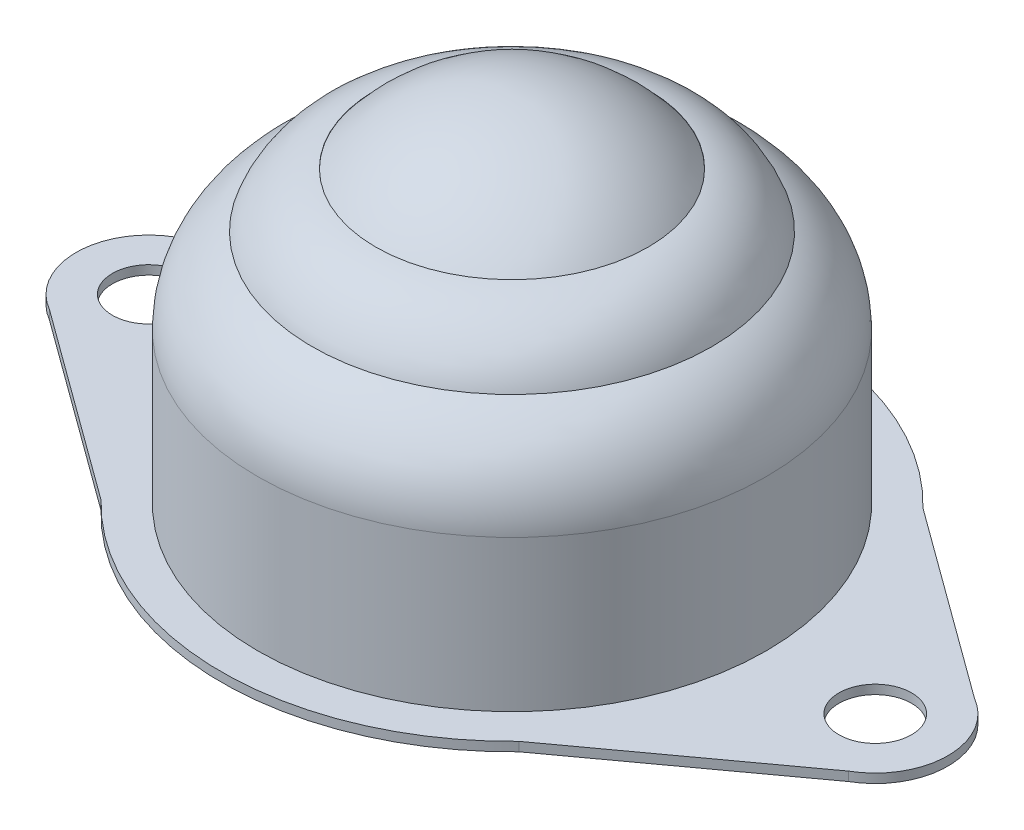
ISO-10303-21;
HEADER;
FILE_DESCRIPTION(('STEP AP214'),'2;1');
FILE_NAME('part.step','',(''),(''),'','','');
FILE_SCHEMA(('AUTOMOTIVE_DESIGN { 1 0 10303 214 1 1 1 1 }'));
ENDSEC;
DATA;
#1=APPLICATION_CONTEXT('core data for automotive mechanical design processes');
#2=APPLICATION_PROTOCOL_DEFINITION('international standard','automotive_design',2000,#1);
#3=PRODUCT_CONTEXT('',#1,'mechanical');
#4=PRODUCT('Part','Part','',(#3));
#5=PRODUCT_RELATED_PRODUCT_CATEGORY('part','',(#4));
#6=PRODUCT_DEFINITION_FORMATION('','',#4);
#7=PRODUCT_DEFINITION_CONTEXT('part definition',#1,'design');
#8=PRODUCT_DEFINITION('design','',#6,#7);
#9=PRODUCT_DEFINITION_SHAPE('','',#8);
#10=(LENGTH_UNIT() NAMED_UNIT(*) SI_UNIT(.MILLI.,.METRE.));
#11=(NAMED_UNIT(*) PLANE_ANGLE_UNIT() SI_UNIT($,.RADIAN.));
#12=(NAMED_UNIT(*) SI_UNIT($,.STERADIAN.) SOLID_ANGLE_UNIT());
#13=UNCERTAINTY_MEASURE_WITH_UNIT(LENGTH_MEASURE(1.E-05),#10,'distance_accuracy_value','');
#14=(GEOMETRIC_REPRESENTATION_CONTEXT(3) GLOBAL_UNCERTAINTY_ASSIGNED_CONTEXT((#13)) GLOBAL_UNIT_ASSIGNED_CONTEXT((#10,
#11,#12)) REPRESENTATION_CONTEXT('',''));
#15=CARTESIAN_POINT('',(0.,0.,0.));
#16=DIRECTION('',(0.,0.,1.));
#17=DIRECTION('',(1.,0.,0.));
#18=AXIS2_PLACEMENT_3D('',#15,#16,#17);
#19=CARTESIAN_POINT('',(0.,9.75,0.));
#20=DIRECTION('',(0.,1.,0.));
#21=DIRECTION('',(1.,0.,0.));
#22=AXIS2_PLACEMENT_3D('',#19,#20,#21);
#23=SPHERICAL_SURFACE('',#22,9.75);
#24=CARTESIAN_POINT('',(0.,19.5,0.));
#25=VERTEX_POINT('',#24);
#26=VERTEX_LOOP('',#25);
#27=FACE_BOUND('',#26,.T.);
#28=ADVANCED_FACE('F44',(#27),#23,.T.);
#29=CLOSED_SHELL('',(#28));
#30=MANIFOLD_SOLID_BREP('B2',#29);
#31=CARTESIAN_POINT('',(0.,8.30667544842264,0.));
#32=DIRECTION('',(0.,-1.,0.));
#33=DIRECTION('',(1.,0.,0.));
#34=AXIS2_PLACEMENT_3D('',#31,#32,#33);
#35=TOROIDAL_SURFACE('',#34,8.82878410892679,5.17121589107318);
#36=CARTESIAN_POINT('',(0.,8.30667544842267,0.));
#37=DIRECTION('',(0.,-1.,0.));
#38=DIRECTION('',(1.,0.,0.));
#39=AXIS2_PLACEMENT_3D('',#36,#37,#38);
#40=CIRCLE('',#39,14.);
#41=CARTESIAN_POINT('',(13.9999999999999,8.30667544842272,0.));
#42=VERTEX_POINT('',#41);
#43=EDGE_CURVE('E184',#42,#42,#40,.T.);
#44=ORIENTED_EDGE('',*,*,#43,.F.);
#45=EDGE_LOOP('',(#44));
#46=FACE_BOUND('',#45,.T.);
#47=CARTESIAN_POINT('',(0.,13.,0.));
#48=DIRECTION('',(0.,-1.,0.));
#49=DIRECTION('',(1.,0.,0.));
#50=AXIS2_PLACEMENT_3D('',#47,#48,#49);
#51=CIRCLE('',#50,10.9999999999999);
#52=CARTESIAN_POINT('',(10.9999999999999,13.0000000000001,0.));
#53=VERTEX_POINT('',#52);
#54=EDGE_CURVE('E42',#53,#53,#51,.T.);
#55=ORIENTED_EDGE('',*,*,#54,.T.);
#56=EDGE_LOOP('',(#55));
#57=FACE_BOUND('',#56,.T.);
#58=ADVANCED_FACE('F56',(#46,#57),#35,.T.);
#59=CARTESIAN_POINT('',(0.,11.5038055215238,0.));
#60=DIRECTION('',(0.,-1.,0.));
#61=DIRECTION('',(1.,0.,0.));
#62=AXIS2_PLACEMENT_3D('',#59,#60,#61);
#63=TOROIDAL_SURFACE('',#62,6.68183330416316,4.57002861374594);
#64=ORIENTED_EDGE('',*,*,#54,.F.);
#65=EDGE_LOOP('',(#64));
#66=FACE_BOUND('',#65,.T.);
#67=CARTESIAN_POINT('',(0.,16.,0.));
#68=DIRECTION('',(0.,-1.,0.));
#69=DIRECTION('',(1.,0.,0.));
#70=AXIS2_PLACEMENT_3D('',#67,#68,#69);
#71=CIRCLE('',#70,7.4999999999999);
#72=CARTESIAN_POINT('',(7.49999999999984,16.,0.));
#73=VERTEX_POINT('',#72);
#74=EDGE_CURVE('E64',#73,#73,#71,.T.);
#75=ORIENTED_EDGE('',*,*,#74,.T.);
#76=EDGE_LOOP('',(#75));
#77=FACE_BOUND('',#76,.T.);
#78=ADVANCED_FACE('F204',(#66,#77),#63,.T.);
#79=CARTESIAN_POINT('',(0.,15.8032312329533,0.));
#80=DIRECTION('',(0.,1.,0.));
#81=DIRECTION('',(-1.,0.,0.));
#82=AXIS2_PLACEMENT_3D('',#79,#80,#81);
#83=CONICAL_SURFACE('',#82,7.46419424187507,0.179999204343552);
#84=ORIENTED_EDGE('',*,*,#74,.F.);
#85=EDGE_LOOP('',(#84));
#86=FACE_BOUND('',#85,.T.);
#87=CARTESIAN_POINT('',(0.,15.8032312329533,0.));
#88=DIRECTION('',(0.,-1.,0.));
#89=DIRECTION('',(1.,0.,0.));
#90=AXIS2_PLACEMENT_3D('',#87,#88,#89);
#91=CIRCLE('',#90,7.46419424187507);
#92=CARTESIAN_POINT('',(7.46419424187501,15.8032312329533,0.));
#93=VERTEX_POINT('',#92);
#94=EDGE_CURVE('E199',#93,#93,#91,.T.);
#95=ORIENTED_EDGE('',*,*,#94,.T.);
#96=EDGE_LOOP('',(#95));
#97=FACE_BOUND('',#96,.T.);
#98=ADVANCED_FACE('F206',(#86,#97),#83,.F.);
#99=CARTESIAN_POINT('',(0.,11.5038055215238,0.));
#100=DIRECTION('',(0.,-1.,0.));
#101=DIRECTION('',(1.,0.,0.));
#102=AXIS2_PLACEMENT_3D('',#99,#100,#101);
#103=TOROIDAL_SURFACE('',#102,6.68183330416316,4.37002861374594);
#104=ORIENTED_EDGE('',*,*,#94,.F.);
#105=EDGE_LOOP('',(#104));
#106=FACE_BOUND('',#105,.T.);
#107=CARTESIAN_POINT('',(0.,12.8537025769554,0.));
#108=DIRECTION('',(0.,-1.,0.));
#109=DIRECTION('',(1.,0.,0.));
#110=AXIS2_PLACEMENT_3D('',#107,#108,#109);
#111=CIRCLE('',#110,10.8381451337418);
#112=CARTESIAN_POINT('',(10.8381451337417,12.8537025769554,0.));
#113=VERTEX_POINT('',#112);
#114=EDGE_CURVE('E196',#113,#113,#111,.T.);
#115=ORIENTED_EDGE('',*,*,#114,.T.);
#116=EDGE_LOOP('',(#115));
#117=FACE_BOUND('',#116,.T.);
#118=ADVANCED_FACE('F209',(#106,#117),#103,.F.);
#119=CARTESIAN_POINT('',(0.,8.30667544842264,0.));
#120=DIRECTION('',(0.,-1.,0.));
#121=DIRECTION('',(1.,0.,0.));
#122=AXIS2_PLACEMENT_3D('',#119,#120,#121);
#123=TOROIDAL_SURFACE('',#122,8.82878410892679,4.97121589107318);
#124=ORIENTED_EDGE('',*,*,#114,.F.);
#125=EDGE_LOOP('',(#124));
#126=FACE_BOUND('',#125,.T.);
#127=CARTESIAN_POINT('',(0.,8.30667544842267,0.));
#128=DIRECTION('',(0.,-1.,0.));
#129=DIRECTION('',(1.,0.,0.));
#130=AXIS2_PLACEMENT_3D('',#127,#128,#129);
#131=CIRCLE('',#130,13.8);
#132=CARTESIAN_POINT('',(13.7999999999999,8.30667544842272,0.));
#133=VERTEX_POINT('',#132);
#134=EDGE_CURVE('E193',#133,#133,#131,.T.);
#135=ORIENTED_EDGE('',*,*,#134,.T.);
#136=EDGE_LOOP('',(#135));
#137=FACE_BOUND('',#136,.T.);
#138=ADVANCED_FACE('F215',(#126,#137),#123,.F.);
#139=CARTESIAN_POINT('',(5.42695743456729E-13,-155.434238590703,0.));
#140=DIRECTION('',(0.,-1.,0.));
#141=DIRECTION('',(1.,0.,0.));
#142=AXIS2_PLACEMENT_3D('',#139,#140,#141);
#143=CYLINDRICAL_SURFACE('',#142,13.8);
#144=ORIENTED_EDGE('',*,*,#134,.F.);
#145=EDGE_LOOP('',(#144));
#146=FACE_BOUND('',#145,.T.);
#147=CARTESIAN_POINT('',(0.,0.200000000000061,0.));
#148=DIRECTION('',(0.,-1.,0.));
#149=DIRECTION('',(1.,0.,0.));
#150=AXIS2_PLACEMENT_3D('',#147,#148,#149);
#151=CIRCLE('',#150,13.8);
#152=CARTESIAN_POINT('',(13.8,0.200000000000109,0.));
#153=VERTEX_POINT('',#152);
#154=EDGE_CURVE('E190',#153,#153,#151,.T.);
#155=ORIENTED_EDGE('',*,*,#154,.T.);
#156=EDGE_LOOP('',(#155));
#157=FACE_BOUND('',#156,.T.);
#158=ADVANCED_FACE('F221',(#146,#157),#143,.F.);
#159=CARTESIAN_POINT('',(-13.8,0.199999999999976,0.));
#160=DIRECTION('',(0.,-1.,0.));
#161=DIRECTION('',(1.,0.,0.));
#162=AXIS2_PLACEMENT_3D('',#159,#160,#161);
#163=PLANE('',#162);
#164=ORIENTED_EDGE('',*,*,#154,.F.);
#165=EDGE_LOOP('',(#164));
#166=FACE_BOUND('',#165,.T.);
#167=ADVANCED_FACE('F227',(#166),#163,.F.);
#168=CARTESIAN_POINT('',(5.42695743456729E-13,-155.434238590703,0.));
#169=DIRECTION('',(0.,-1.,0.));
#170=DIRECTION('',(1.,0.,0.));
#171=AXIS2_PLACEMENT_3D('',#168,#169,#170);
#172=CYLINDRICAL_SURFACE('',#171,14.);
#173=CARTESIAN_POINT('',(0.,0.,0.));
#174=DIRECTION('',(0.,-1.,0.));
#175=DIRECTION('',(1.,0.,0.));
#176=AXIS2_PLACEMENT_3D('',#173,#174,#175);
#177=CIRCLE('',#176,14.);
#178=CARTESIAN_POINT('',(14.,1.04391889975062E-13,0.));
#179=VERTEX_POINT('',#178);
#180=EDGE_CURVE('E187',#179,#179,#177,.T.);
#181=ORIENTED_EDGE('',*,*,#180,.F.);
#182=EDGE_LOOP('',(#181));
#183=FACE_BOUND('',#182,.T.);
#184=ORIENTED_EDGE('',*,*,#43,.T.);
#185=EDGE_LOOP('',(#184));
#186=FACE_BOUND('',#185,.T.);
#187=ADVANCED_FACE('F232',(#183,#186),#172,.T.);
#188=CARTESIAN_POINT('',(0.,-0.5,0.));
#189=DIRECTION('',(0.,-1.,0.));
#190=DIRECTION('',(1.,0.,0.));
#191=AXIS2_PLACEMENT_3D('',#188,#189,#190);
#192=PLANE('',#191);
#193=CARTESIAN_POINT('',(-20.,-0.50000000000007,0.));
#194=DIRECTION('',(0.,-1.,0.));
#195=DIRECTION('',(-1.,0.,0.));
#196=AXIS2_PLACEMENT_3D('',#193,#194,#195);
#197=CIRCLE('',#196,2.);
#198=CARTESIAN_POINT('',(-22.,-0.500000000000077,0.));
#199=VERTEX_POINT('',#198);
#200=EDGE_CURVE('E158',#199,#199,#197,.T.);
#201=ORIENTED_EDGE('',*,*,#200,.F.);
#202=EDGE_LOOP('',(#201));
#203=FACE_BOUND('',#202,.T.);
#204=CARTESIAN_POINT('',(0.,-0.5,0.));
#205=DIRECTION('',(0.,-1.,0.));
#206=DIRECTION('',(1.,0.,0.));
#207=AXIS2_PLACEMENT_3D('',#204,#205,#206);
#208=CIRCLE('',#207,16.);
#209=CARTESIAN_POINT('',(11.4999999999999,-0.49999999999996,11.1242977306435));
#210=VERTEX_POINT('',#209);
#211=CARTESIAN_POINT('',(-11.5,-0.50000000000004,11.1242977306435));
#212=VERTEX_POINT('',#211);
#213=EDGE_CURVE('E169',#210,#212,#208,.T.);
#214=ORIENTED_EDGE('',*,*,#213,.T.);
#215=DIRECTION('',(-0.807862969973212,0.,-0.589370360423784));
#216=VECTOR('',#215,1.);
#217=CARTESIAN_POINT('',(-22.,-0.500000000000077,3.46410161513776));
#218=LINE('',#217,#216);
#219=CARTESIAN_POINT('',(-22.,-0.500000000000077,3.46410161513776));
#220=VERTEX_POINT('',#219);
#221=EDGE_CURVE('E116',#212,#220,#218,.T.);
#222=ORIENTED_EDGE('',*,*,#221,.T.);
#223=CARTESIAN_POINT('',(-20.,-0.50000000000007,0.));
#224=DIRECTION('',(0.,-1.,0.));
#225=DIRECTION('',(-1.,0.,0.));
#226=AXIS2_PLACEMENT_3D('',#223,#224,#225);
#227=CIRCLE('',#226,4.);
#228=CARTESIAN_POINT('',(-22.,-0.500000000000077,-3.46410161513776));
#229=VERTEX_POINT('',#228);
#230=EDGE_CURVE('E412',#220,#229,#227,.T.);
#231=ORIENTED_EDGE('',*,*,#230,.T.);
#232=DIRECTION('',(0.807862969973212,0.,-0.589370360423784));
#233=VECTOR('',#232,1.);
#234=CARTESIAN_POINT('',(-11.5,-0.50000000000004,-11.1242977306435));
#235=LINE('',#234,#233);
#236=CARTESIAN_POINT('',(-11.5,-0.50000000000004,-11.1242977306435));
#237=VERTEX_POINT('',#236);
#238=EDGE_CURVE('E414',#229,#237,#235,.T.);
#239=ORIENTED_EDGE('',*,*,#238,.T.);
#240=CARTESIAN_POINT('',(0.,-0.5,0.));
#241=DIRECTION('',(0.,-1.,0.));
#242=DIRECTION('',(1.,0.,0.));
#243=AXIS2_PLACEMENT_3D('',#240,#241,#242);
#244=CIRCLE('',#243,16.);
#245=CARTESIAN_POINT('',(11.5000000000001,-0.49999999999996,-11.1242977306435));
#246=VERTEX_POINT('',#245);
#247=EDGE_CURVE('E136',#237,#246,#244,.T.);
#248=ORIENTED_EDGE('',*,*,#247,.T.);
#249=DIRECTION('',(0.807862969973203,0.,0.589370360423797));
#250=VECTOR('',#249,1.);
#251=CARTESIAN_POINT('',(11.5000000000001,-0.49999999999996,-11.1242977306435));
#252=LINE('',#251,#250);
#253=CARTESIAN_POINT('',(22.,-0.499999999999923,-3.46410161513753));
#254=VERTEX_POINT('',#253);
#255=EDGE_CURVE('E129',#246,#254,#252,.T.);
#256=ORIENTED_EDGE('',*,*,#255,.T.);
#257=CARTESIAN_POINT('',(20.,-0.49999999999993,0.));
#258=DIRECTION('',(0.,-1.,0.));
#259=DIRECTION('',(1.,0.,0.));
#260=AXIS2_PLACEMENT_3D('',#257,#258,#259);
#261=CIRCLE('',#260,3.9999999999999);
#262=CARTESIAN_POINT('',(21.9999999999999,-0.499999999999923,3.46410161513768));
#263=VERTEX_POINT('',#262);
#264=EDGE_CURVE('E134',#254,#263,#261,.T.);
#265=ORIENTED_EDGE('',*,*,#264,.T.);
#266=DIRECTION('',(-0.807862969973213,0.,0.589370360423782));
#267=VECTOR('',#266,1.);
#268=CARTESIAN_POINT('',(22.,-0.499999999999923,3.46410161513776));
#269=LINE('',#268,#267);
#270=EDGE_CURVE('E72',#263,#210,#269,.T.);
#271=ORIENTED_EDGE('',*,*,#270,.T.);
#272=EDGE_LOOP('',(#214,#222,#231,#239,#248,#256,#265,#271));
#273=FACE_BOUND('',#272,.T.);
#274=CARTESIAN_POINT('',(20.,-0.49999999999993,0.));
#275=DIRECTION('',(0.,-1.,0.));
#276=DIRECTION('',(1.,0.,0.));
#277=AXIS2_PLACEMENT_3D('',#274,#275,#276);
#278=CIRCLE('',#277,2.00000000000001);
#279=CARTESIAN_POINT('',(22.,-0.499999999999923,0.));
#280=VERTEX_POINT('',#279);
#281=EDGE_CURVE('E397',#280,#280,#278,.T.);
#282=ORIENTED_EDGE('',*,*,#281,.F.);
#283=EDGE_LOOP('',(#282));
#284=FACE_BOUND('',#283,.T.);
#285=ADVANCED_FACE('F131',(#203,#273,#284),#192,.T.);
#286=CARTESIAN_POINT('',(0.,0.,0.));
#287=DIRECTION('',(0.,-1.,0.));
#288=DIRECTION('',(1.,0.,0.));
#289=AXIS2_PLACEMENT_3D('',#286,#287,#288);
#290=PLANE('',#289);
#291=ORIENTED_EDGE('',*,*,#180,.T.);
#292=EDGE_LOOP('',(#291));
#293=FACE_BOUND('',#292,.T.);
#294=CARTESIAN_POINT('',(0.,0.,0.));
#295=DIRECTION('',(0.,-1.,0.));
#296=DIRECTION('',(1.,0.,0.));
#297=AXIS2_PLACEMENT_3D('',#294,#295,#296);
#298=CIRCLE('',#297,16.);
#299=CARTESIAN_POINT('',(11.4999999999999,0.,11.1242977306435));
#300=VERTEX_POINT('',#299);
#301=CARTESIAN_POINT('',(-11.5,0.,11.1242977306435));
#302=VERTEX_POINT('',#301);
#303=EDGE_CURVE('E154',#300,#302,#298,.T.);
#304=ORIENTED_EDGE('',*,*,#303,.F.);
#305=DIRECTION('',(-0.807862969973213,0.,0.589370360423782));
#306=VECTOR('',#305,1.);
#307=CARTESIAN_POINT('',(22.,0.,3.46410161513776));
#308=LINE('',#307,#306);
#309=CARTESIAN_POINT('',(21.9999999999999,0.,3.46410161513768));
#310=VERTEX_POINT('',#309);
#311=EDGE_CURVE('E107',#310,#300,#308,.T.);
#312=ORIENTED_EDGE('',*,*,#311,.F.);
#313=CARTESIAN_POINT('',(20.,0.,0.));
#314=DIRECTION('',(0.,-1.,0.));
#315=DIRECTION('',(1.,0.,0.));
#316=AXIS2_PLACEMENT_3D('',#313,#314,#315);
#317=CIRCLE('',#316,3.9999999999999);
#318=CARTESIAN_POINT('',(22.,0.,-3.46410161513753));
#319=VERTEX_POINT('',#318);
#320=EDGE_CURVE('E101',#319,#310,#317,.T.);
#321=ORIENTED_EDGE('',*,*,#320,.F.);
#322=DIRECTION('',(0.807862969973203,0.,0.589370360423797));
#323=VECTOR('',#322,1.);
#324=CARTESIAN_POINT('',(11.5000000000001,0.,-11.1242977306435));
#325=LINE('',#324,#323);
#326=CARTESIAN_POINT('',(11.5000000000001,0.,-11.1242977306435));
#327=VERTEX_POINT('',#326);
#328=EDGE_CURVE('E144',#327,#319,#325,.T.);
#329=ORIENTED_EDGE('',*,*,#328,.F.);
#330=CARTESIAN_POINT('',(0.,0.,0.));
#331=DIRECTION('',(0.,-1.,0.));
#332=DIRECTION('',(1.,0.,0.));
#333=AXIS2_PLACEMENT_3D('',#330,#331,#332);
#334=CIRCLE('',#333,16.);
#335=CARTESIAN_POINT('',(-11.5,0.,-11.1242977306435));
#336=VERTEX_POINT('',#335);
#337=EDGE_CURVE('E164',#336,#327,#334,.T.);
#338=ORIENTED_EDGE('',*,*,#337,.F.);
#339=DIRECTION('',(0.807862969973212,0.,-0.589370360423784));
#340=VECTOR('',#339,1.);
#341=CARTESIAN_POINT('',(-11.5,0.,-11.1242977306435));
#342=LINE('',#341,#340);
#343=CARTESIAN_POINT('',(-22.,0.,-3.46410161513776));
#344=VERTEX_POINT('',#343);
#345=EDGE_CURVE('E162',#344,#336,#342,.T.);
#346=ORIENTED_EDGE('',*,*,#345,.F.);
#347=CARTESIAN_POINT('',(-20.,0.,0.));
#348=DIRECTION('',(0.,-1.,0.));
#349=DIRECTION('',(-1.,0.,0.));
#350=AXIS2_PLACEMENT_3D('',#347,#348,#349);
#351=CIRCLE('',#350,4.);
#352=CARTESIAN_POINT('',(-22.,0.,3.46410161513776));
#353=VERTEX_POINT('',#352);
#354=EDGE_CURVE('E160',#353,#344,#351,.T.);
#355=ORIENTED_EDGE('',*,*,#354,.F.);
#356=DIRECTION('',(-0.807862969973212,0.,-0.589370360423784));
#357=VECTOR('',#356,1.);
#358=CARTESIAN_POINT('',(-22.,0.,3.46410161513776));
#359=LINE('',#358,#357);
#360=EDGE_CURVE('E157',#302,#353,#359,.T.);
#361=ORIENTED_EDGE('',*,*,#360,.F.);
#362=EDGE_LOOP('',(#304,#312,#321,#329,#338,#346,#355,#361));
#363=FACE_BOUND('',#362,.T.);
#364=CARTESIAN_POINT('',(-20.,0.,0.));
#365=DIRECTION('',(0.,-1.,0.));
#366=DIRECTION('',(-1.,0.,0.));
#367=AXIS2_PLACEMENT_3D('',#364,#365,#366);
#368=CIRCLE('',#367,2.);
#369=CARTESIAN_POINT('',(-22.,0.,0.));
#370=VERTEX_POINT('',#369);
#371=EDGE_CURVE('E403',#370,#370,#368,.T.);
#372=ORIENTED_EDGE('',*,*,#371,.T.);
#373=EDGE_LOOP('',(#372));
#374=FACE_BOUND('',#373,.T.);
#375=CARTESIAN_POINT('',(20.,0.,0.));
#376=DIRECTION('',(0.,-1.,0.));
#377=DIRECTION('',(1.,0.,0.));
#378=AXIS2_PLACEMENT_3D('',#375,#376,#377);
#379=CIRCLE('',#378,2.00000000000001);
#380=CARTESIAN_POINT('',(22.,0.,0.));
#381=VERTEX_POINT('',#380);
#382=EDGE_CURVE('E400',#381,#381,#379,.T.);
#383=ORIENTED_EDGE('',*,*,#382,.T.);
#384=EDGE_LOOP('',(#383));
#385=FACE_BOUND('',#384,.T.);
#386=ADVANCED_FACE('F286',(#293,#363,#374,#385),#290,.F.);
#387=CARTESIAN_POINT('',(0.,-0.5,0.));
#388=DIRECTION('',(0.,1.,0.));
#389=DIRECTION('',(-1.,0.,0.));
#390=AXIS2_PLACEMENT_3D('',#387,#388,#389);
#391=CYLINDRICAL_SURFACE('',#390,16.);
#392=ORIENTED_EDGE('',*,*,#303,.T.);
#393=DIRECTION('',(0.,1.,0.));
#394=VECTOR('',#393,1.);
#395=CARTESIAN_POINT('',(-11.5,-0.50000000000004,11.1242977306435));
#396=LINE('',#395,#394);
#397=EDGE_CURVE('E182',#212,#302,#396,.T.);
#398=ORIENTED_EDGE('',*,*,#397,.F.);
#399=ORIENTED_EDGE('',*,*,#213,.F.);
#400=DIRECTION('',(0.,1.,0.));
#401=VECTOR('',#400,1.);
#402=CARTESIAN_POINT('',(11.4999999999999,-0.49999999999996,11.1242977306435));
#403=LINE('',#402,#401);
#404=EDGE_CURVE('E150',#210,#300,#403,.T.);
#405=ORIENTED_EDGE('',*,*,#404,.T.);
#406=EDGE_LOOP('',(#392,#398,#399,#405));
#407=FACE_BOUND('',#406,.T.);
#408=ADVANCED_FACE('F296',(#407),#391,.T.);
#409=CARTESIAN_POINT('',(-22.,-0.500000000000077,3.46410161513776));
#410=DIRECTION('',(0.589370360423784,0.,-0.807862969973212));
#411=DIRECTION('',(-0.807862969973212,0.,-0.589370360423784));
#412=AXIS2_PLACEMENT_3D('',#409,#410,#411);
#413=PLANE('',#412);
#414=ORIENTED_EDGE('',*,*,#360,.T.);
#415=DIRECTION('',(0.,1.,0.));
#416=VECTOR('',#415,1.);
#417=CARTESIAN_POINT('',(-22.,-0.500000000000077,3.46410161513776));
#418=LINE('',#417,#416);
#419=EDGE_CURVE('E179',#220,#353,#418,.T.);
#420=ORIENTED_EDGE('',*,*,#419,.F.);
#421=ORIENTED_EDGE('',*,*,#221,.F.);
#422=ORIENTED_EDGE('',*,*,#397,.T.);
#423=EDGE_LOOP('',(#414,#420,#421,#422));
#424=FACE_BOUND('',#423,.T.);
#425=ADVANCED_FACE('F306',(#424),#413,.F.);
#426=CARTESIAN_POINT('',(-20.,-0.50000000000007,0.));
#427=DIRECTION('',(0.,1.,0.));
#428=DIRECTION('',(-1.,0.,0.));
#429=AXIS2_PLACEMENT_3D('',#426,#427,#428);
#430=CYLINDRICAL_SURFACE('',#429,4.);
#431=ORIENTED_EDGE('',*,*,#354,.T.);
#432=DIRECTION('',(0.,1.,0.));
#433=VECTOR('',#432,1.);
#434=CARTESIAN_POINT('',(-22.,-0.500000000000077,-3.46410161513776));
#435=LINE('',#434,#433);
#436=EDGE_CURVE('E176',#229,#344,#435,.T.);
#437=ORIENTED_EDGE('',*,*,#436,.F.);
#438=ORIENTED_EDGE('',*,*,#230,.F.);
#439=ORIENTED_EDGE('',*,*,#419,.T.);
#440=EDGE_LOOP('',(#431,#437,#438,#439));
#441=FACE_BOUND('',#440,.T.);
#442=ADVANCED_FACE('F316',(#441),#430,.T.);
#443=CARTESIAN_POINT('',(-11.5,-0.50000000000004,-11.1242977306435));
#444=DIRECTION('',(0.589370360423784,0.,0.807862969973212));
#445=DIRECTION('',(0.807862969973212,0.,-0.589370360423784));
#446=AXIS2_PLACEMENT_3D('',#443,#444,#445);
#447=PLANE('',#446);
#448=ORIENTED_EDGE('',*,*,#345,.T.);
#449=DIRECTION('',(0.,1.,0.));
#450=VECTOR('',#449,1.);
#451=CARTESIAN_POINT('',(-11.5,-0.50000000000004,-11.1242977306435));
#452=LINE('',#451,#450);
#453=EDGE_CURVE('E173',#237,#336,#452,.T.);
#454=ORIENTED_EDGE('',*,*,#453,.F.);
#455=ORIENTED_EDGE('',*,*,#238,.F.);
#456=ORIENTED_EDGE('',*,*,#436,.T.);
#457=EDGE_LOOP('',(#448,#454,#455,#456));
#458=FACE_BOUND('',#457,.T.);
#459=ADVANCED_FACE('F325',(#458),#447,.F.);
#460=CARTESIAN_POINT('',(0.,-0.5,0.));
#461=DIRECTION('',(0.,1.,0.));
#462=DIRECTION('',(-1.,0.,0.));
#463=AXIS2_PLACEMENT_3D('',#460,#461,#462);
#464=CYLINDRICAL_SURFACE('',#463,16.);
#465=ORIENTED_EDGE('',*,*,#337,.T.);
#466=DIRECTION('',(0.,1.,0.));
#467=VECTOR('',#466,1.);
#468=CARTESIAN_POINT('',(11.5000000000001,-0.49999999999996,-11.1242977306435));
#469=LINE('',#468,#467);
#470=EDGE_CURVE('E145',#246,#327,#469,.T.);
#471=ORIENTED_EDGE('',*,*,#470,.F.);
#472=ORIENTED_EDGE('',*,*,#247,.F.);
#473=ORIENTED_EDGE('',*,*,#453,.T.);
#474=EDGE_LOOP('',(#465,#471,#472,#473));
#475=FACE_BOUND('',#474,.T.);
#476=ADVANCED_FACE('F335',(#475),#464,.T.);
#477=CARTESIAN_POINT('',(11.5000000000001,-0.49999999999996,-11.1242977306435));
#478=DIRECTION('',(-0.589370360423797,0.,0.807862969973203));
#479=DIRECTION('',(0.807862969973202,0.,0.589370360423797));
#480=AXIS2_PLACEMENT_3D('',#477,#478,#479);
#481=PLANE('',#480);
#482=ORIENTED_EDGE('',*,*,#328,.T.);
#483=DIRECTION('',(0.,1.,0.));
#484=VECTOR('',#483,1.);
#485=CARTESIAN_POINT('',(22.,-0.499999999999923,-3.46410161513753));
#486=LINE('',#485,#484);
#487=EDGE_CURVE('E141',#254,#319,#486,.T.);
#488=ORIENTED_EDGE('',*,*,#487,.F.);
#489=ORIENTED_EDGE('',*,*,#255,.F.);
#490=ORIENTED_EDGE('',*,*,#470,.T.);
#491=EDGE_LOOP('',(#482,#488,#489,#490));
#492=FACE_BOUND('',#491,.T.);
#493=ADVANCED_FACE('F142',(#492),#481,.F.);
#494=CARTESIAN_POINT('',(20.,-0.49999999999993,0.));
#495=DIRECTION('',(0.,1.,0.));
#496=DIRECTION('',(-1.,0.,0.));
#497=AXIS2_PLACEMENT_3D('',#494,#495,#496);
#498=CYLINDRICAL_SURFACE('',#497,3.9999999999999);
#499=ORIENTED_EDGE('',*,*,#320,.T.);
#500=DIRECTION('',(0.,1.,0.));
#501=VECTOR('',#500,1.);
#502=CARTESIAN_POINT('',(21.9999999999999,-0.499999999999923,3.46410161513768));
#503=LINE('',#502,#501);
#504=EDGE_CURVE('E146',#263,#310,#503,.T.);
#505=ORIENTED_EDGE('',*,*,#504,.F.);
#506=ORIENTED_EDGE('',*,*,#264,.F.);
#507=ORIENTED_EDGE('',*,*,#487,.T.);
#508=EDGE_LOOP('',(#499,#505,#506,#507));
#509=FACE_BOUND('',#508,.T.);
#510=ADVANCED_FACE('F148',(#509),#498,.T.);
#511=CARTESIAN_POINT('',(22.,-0.499999999999923,3.46410161513776));
#512=DIRECTION('',(-0.589370360423782,0.,-0.807862969973213));
#513=DIRECTION('',(-0.807862969973213,0.,0.589370360423782));
#514=AXIS2_PLACEMENT_3D('',#511,#512,#513);
#515=PLANE('',#514);
#516=ORIENTED_EDGE('',*,*,#311,.T.);
#517=ORIENTED_EDGE('',*,*,#404,.F.);
#518=ORIENTED_EDGE('',*,*,#270,.F.);
#519=ORIENTED_EDGE('',*,*,#504,.T.);
#520=EDGE_LOOP('',(#516,#517,#518,#519));
#521=FACE_BOUND('',#520,.T.);
#522=ADVANCED_FACE('F362',(#521),#515,.F.);
#523=CARTESIAN_POINT('',(-20.,-0.50000000000007,0.));
#524=DIRECTION('',(0.,1.,0.));
#525=DIRECTION('',(-1.,0.,0.));
#526=AXIS2_PLACEMENT_3D('',#523,#524,#525);
#527=CYLINDRICAL_SURFACE('',#526,2.);
#528=ORIENTED_EDGE('',*,*,#200,.T.);
#529=EDGE_LOOP('',(#528));
#530=FACE_BOUND('',#529,.T.);
#531=ORIENTED_EDGE('',*,*,#371,.F.);
#532=EDGE_LOOP('',(#531));
#533=FACE_BOUND('',#532,.T.);
#534=ADVANCED_FACE('F371',(#530,#533),#527,.F.);
#535=CARTESIAN_POINT('',(20.,-0.49999999999993,0.));
#536=DIRECTION('',(0.,1.,0.));
#537=DIRECTION('',(-1.,0.,0.));
#538=AXIS2_PLACEMENT_3D('',#535,#536,#537);
#539=CYLINDRICAL_SURFACE('',#538,2.00000000000001);
#540=ORIENTED_EDGE('',*,*,#281,.T.);
#541=EDGE_LOOP('',(#540));
#542=FACE_BOUND('',#541,.T.);
#543=ORIENTED_EDGE('',*,*,#382,.F.);
#544=EDGE_LOOP('',(#543));
#545=FACE_BOUND('',#544,.T.);
#546=ADVANCED_FACE('F380',(#542,#545),#539,.F.);
#547=CLOSED_SHELL('',(#58,#78,#98,#118,#138,#158,#167,#187,#285,#386,#408,#425,#442,#459,#476,
#493,#510,#522,#534,#546));
#548=MANIFOLD_SOLID_BREP('B6',#547);
#549=ADVANCED_BREP_SHAPE_REPRESENTATION('',(#18,#30,#548),#14);
#550=SHAPE_DEFINITION_REPRESENTATION(#9,#549);
ENDSEC;
END-ISO-10303-21;
